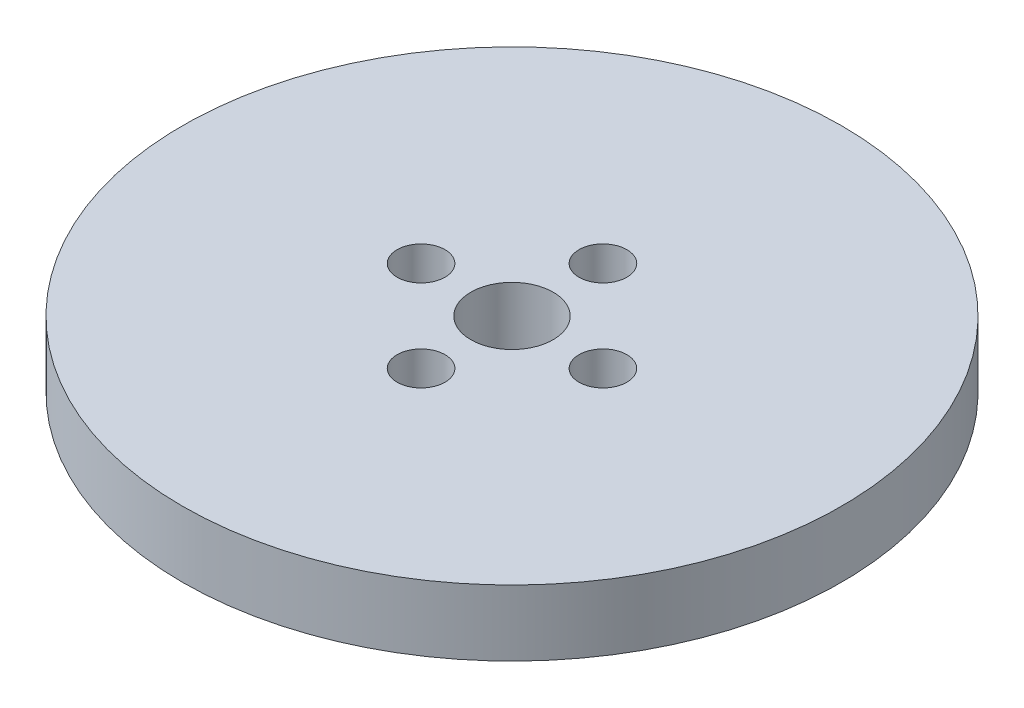
ISO-10303-21;
HEADER;
FILE_DESCRIPTION(('STEP AP214'),'2;1');
FILE_NAME('part.step','',(''),(''),'','','');
FILE_SCHEMA(('AUTOMOTIVE_DESIGN { 1 0 10303 214 1 1 1 1 }'));
ENDSEC;
DATA;
#1=APPLICATION_CONTEXT('core data for automotive mechanical design processes');
#2=APPLICATION_PROTOCOL_DEFINITION('international standard','automotive_design',2000,#1);
#3=PRODUCT_CONTEXT('',#1,'mechanical');
#4=PRODUCT('Part','Part','',(#3));
#5=PRODUCT_RELATED_PRODUCT_CATEGORY('part','',(#4));
#6=PRODUCT_DEFINITION_FORMATION('','',#4);
#7=PRODUCT_DEFINITION_CONTEXT('part definition',#1,'design');
#8=PRODUCT_DEFINITION('design','',#6,#7);
#9=PRODUCT_DEFINITION_SHAPE('','',#8);
#10=(LENGTH_UNIT() NAMED_UNIT(*) SI_UNIT(.MILLI.,.METRE.));
#11=(NAMED_UNIT(*) PLANE_ANGLE_UNIT() SI_UNIT($,.RADIAN.));
#12=(NAMED_UNIT(*) SI_UNIT($,.STERADIAN.) SOLID_ANGLE_UNIT());
#13=UNCERTAINTY_MEASURE_WITH_UNIT(LENGTH_MEASURE(1.E-05),#10,'distance_accuracy_value','');
#14=(GEOMETRIC_REPRESENTATION_CONTEXT(3) GLOBAL_UNCERTAINTY_ASSIGNED_CONTEXT((#13)) GLOBAL_UNIT_ASSIGNED_CONTEXT((#10,
#11,#12)) REPRESENTATION_CONTEXT('',''));
#15=CARTESIAN_POINT('',(0.,0.,0.));
#16=DIRECTION('',(0.,0.,1.));
#17=DIRECTION('',(1.,0.,0.));
#18=AXIS2_PLACEMENT_3D('',#15,#16,#17);
#19=CARTESIAN_POINT('',(0.,8.,0.));
#20=DIRECTION('',(0.,-1.,0.));
#21=DIRECTION('',(0.,0.,-1.));
#22=AXIS2_PLACEMENT_3D('',#19,#20,#21);
#23=CYLINDRICAL_SURFACE('',#22,40.);
#24=CARTESIAN_POINT('',(0.,8.,0.));
#25=DIRECTION('',(0.,1.,0.));
#26=DIRECTION('',(0.,0.,1.));
#27=AXIS2_PLACEMENT_3D('',#24,#25,#26);
#28=CIRCLE('',#27,40.);
#29=CARTESIAN_POINT('',(0.,8.,40.));
#30=VERTEX_POINT('',#29);
#31=EDGE_CURVE('E10',#30,#30,#28,.T.);
#32=ORIENTED_EDGE('',*,*,#31,.F.);
#33=EDGE_LOOP('',(#32));
#34=FACE_BOUND('',#33,.T.);
#35=CARTESIAN_POINT('',(0.,0.,0.));
#36=DIRECTION('',(0.,1.,0.));
#37=DIRECTION('',(0.,0.,1.));
#38=AXIS2_PLACEMENT_3D('',#35,#36,#37);
#39=CIRCLE('',#38,40.);
#40=CARTESIAN_POINT('',(0.,0.,40.));
#41=VERTEX_POINT('',#40);
#42=EDGE_CURVE('E37',#41,#41,#39,.T.);
#43=ORIENTED_EDGE('',*,*,#42,.T.);
#44=EDGE_LOOP('',(#43));
#45=FACE_BOUND('',#44,.T.);
#46=ADVANCED_FACE('F40',(#34,#45),#23,.T.);
#47=CARTESIAN_POINT('',(0.,8.,0.));
#48=DIRECTION('',(0.,1.,0.));
#49=DIRECTION('',(0.,0.,1.));
#50=AXIS2_PLACEMENT_3D('',#47,#48,#49);
#51=PLANE('',#50);
#52=CARTESIAN_POINT('',(0.,8.,11.0372925911838));
#53=DIRECTION('',(0.,1.,0.));
#54=DIRECTION('',(1.,0.,0.));
#55=AXIS2_PLACEMENT_3D('',#52,#53,#54);
#56=CIRCLE('',#55,2.90499558066057);
#57=CARTESIAN_POINT('',(2.90499558066061,8.,11.0372925911838));
#58=VERTEX_POINT('',#57);
#59=EDGE_CURVE('E71',#58,#58,#56,.T.);
#60=ORIENTED_EDGE('',*,*,#59,.F.);
#61=EDGE_LOOP('',(#60));
#62=FACE_BOUND('',#61,.T.);
#63=CARTESIAN_POINT('',(11.0372925911838,8.,0.));
#64=DIRECTION('',(0.,1.,0.));
#65=DIRECTION('',(0.,0.,-1.));
#66=AXIS2_PLACEMENT_3D('',#63,#64,#65);
#67=CIRCLE('',#66,2.90499558066057);
#68=CARTESIAN_POINT('',(11.0372925911838,8.,-2.90499558066057));
#69=VERTEX_POINT('',#68);
#70=EDGE_CURVE('E70',#69,#69,#67,.T.);
#71=ORIENTED_EDGE('',*,*,#70,.F.);
#72=EDGE_LOOP('',(#71));
#73=FACE_BOUND('',#72,.T.);
#74=CARTESIAN_POINT('',(-1.15609503340409E-13,8.,-11.0372925911838));
#75=DIRECTION('',(0.,1.,0.));
#76=DIRECTION('',(-1.,0.,0.));
#77=AXIS2_PLACEMENT_3D('',#74,#75,#76);
#78=CIRCLE('',#77,2.90499558066057);
#79=CARTESIAN_POINT('',(-2.90499558066068,8.,-11.0372925911837));
#80=VERTEX_POINT('',#79);
#81=EDGE_CURVE('E61',#80,#80,#78,.T.);
#82=ORIENTED_EDGE('',*,*,#81,.F.);
#83=EDGE_LOOP('',(#82));
#84=FACE_BOUND('',#83,.T.);
#85=CARTESIAN_POINT('',(-11.0372925911838,8.,0.));
#86=DIRECTION('',(0.,1.,0.));
#87=DIRECTION('',(0.,0.,1.));
#88=AXIS2_PLACEMENT_3D('',#85,#86,#87);
#89=CIRCLE('',#88,2.90499558066057);
#90=CARTESIAN_POINT('',(-11.0372925911838,8.,2.90499558066057));
#91=VERTEX_POINT('',#90);
#92=EDGE_CURVE('E54',#91,#91,#89,.T.);
#93=ORIENTED_EDGE('',*,*,#92,.F.);
#94=EDGE_LOOP('',(#93));
#95=FACE_BOUND('',#94,.T.);
#96=CARTESIAN_POINT('',(0.,8.,0.));
#97=DIRECTION('',(0.,1.,0.));
#98=DIRECTION('',(0.,0.,1.));
#99=AXIS2_PLACEMENT_3D('',#96,#97,#98);
#100=CIRCLE('',#99,5.);
#101=CARTESIAN_POINT('',(0.,8.,5.));
#102=VERTEX_POINT('',#101);
#103=EDGE_CURVE('E50',#102,#102,#100,.T.);
#104=ORIENTED_EDGE('',*,*,#103,.F.);
#105=EDGE_LOOP('',(#104));
#106=FACE_BOUND('',#105,.T.);
#107=ORIENTED_EDGE('',*,*,#31,.T.);
#108=EDGE_LOOP('',(#107));
#109=FACE_BOUND('',#108,.T.);
#110=ADVANCED_FACE('F86',(#62,#73,#84,#95,#106,#109),#51,.T.);
#111=CARTESIAN_POINT('',(0.,0.,0.));
#112=DIRECTION('',(0.,1.,0.));
#113=DIRECTION('',(0.,0.,1.));
#114=AXIS2_PLACEMENT_3D('',#111,#112,#113);
#115=PLANE('',#114);
#116=CARTESIAN_POINT('',(0.,0.,0.));
#117=DIRECTION('',(0.,1.,0.));
#118=DIRECTION('',(0.,0.,1.));
#119=AXIS2_PLACEMENT_3D('',#116,#117,#118);
#120=CIRCLE('',#119,5.);
#121=CARTESIAN_POINT('',(0.,0.,5.));
#122=VERTEX_POINT('',#121);
#123=EDGE_CURVE('E47',#122,#122,#120,.T.);
#124=ORIENTED_EDGE('',*,*,#123,.T.);
#125=EDGE_LOOP('',(#124));
#126=FACE_BOUND('',#125,.T.);
#127=ORIENTED_EDGE('',*,*,#42,.F.);
#128=EDGE_LOOP('',(#127));
#129=FACE_BOUND('',#128,.T.);
#130=ADVANCED_FACE('F93',(#126,#129),#115,.F.);
#131=CARTESIAN_POINT('',(0.,8.,0.));
#132=DIRECTION('',(0.,-1.,0.));
#133=DIRECTION('',(0.,0.,-1.));
#134=AXIS2_PLACEMENT_3D('',#131,#132,#133);
#135=CYLINDRICAL_SURFACE('',#134,5.);
#136=ORIENTED_EDGE('',*,*,#103,.T.);
#137=EDGE_LOOP('',(#136));
#138=FACE_BOUND('',#137,.T.);
#139=ORIENTED_EDGE('',*,*,#123,.F.);
#140=EDGE_LOOP('',(#139));
#141=FACE_BOUND('',#140,.T.);
#142=ADVANCED_FACE('F101',(#138,#141),#135,.F.);
#143=CARTESIAN_POINT('',(-11.0372925911838,1.4396676305779,0.));
#144=DIRECTION('',(0.,1.,0.));
#145=DIRECTION('',(0.,0.,1.));
#146=AXIS2_PLACEMENT_3D('',#143,#144,#145);
#147=CYLINDRICAL_SURFACE('',#146,2.90499558066057);
#148=CARTESIAN_POINT('',(-11.0372925911838,1.4396676305779,0.));
#149=DIRECTION('',(0.,1.,0.));
#150=DIRECTION('',(0.,0.,1.));
#151=AXIS2_PLACEMENT_3D('',#148,#149,#150);
#152=CIRCLE('',#151,2.90499558066057);
#153=CARTESIAN_POINT('',(-11.0372925911838,1.4396676305779,2.90499558066057));
#154=VERTEX_POINT('',#153);
#155=EDGE_CURVE('E55',#154,#154,#152,.T.);
#156=ORIENTED_EDGE('',*,*,#155,.F.);
#157=EDGE_LOOP('',(#156));
#158=FACE_BOUND('',#157,.T.);
#159=ORIENTED_EDGE('',*,*,#92,.T.);
#160=EDGE_LOOP('',(#159));
#161=FACE_BOUND('',#160,.T.);
#162=ADVANCED_FACE('F102',(#158,#161),#147,.F.);
#163=CARTESIAN_POINT('',(-11.0372925911838,1.4396676305779,0.));
#164=DIRECTION('',(0.,1.,0.));
#165=DIRECTION('',(0.,0.,1.));
#166=AXIS2_PLACEMENT_3D('',#163,#164,#165);
#167=PLANE('',#166);
#168=ORIENTED_EDGE('',*,*,#155,.T.);
#169=EDGE_LOOP('',(#168));
#170=FACE_BOUND('',#169,.T.);
#171=ADVANCED_FACE('F133',(#170),#167,.T.);
#172=CARTESIAN_POINT('',(-1.15609503340409E-13,1.4396676305779,-11.0372925911838));
#173=DIRECTION('',(0.,1.,0.));
#174=DIRECTION('',(0.,0.,1.));
#175=AXIS2_PLACEMENT_3D('',#172,#173,#174);
#176=CYLINDRICAL_SURFACE('',#175,2.90499558066057);
#177=CARTESIAN_POINT('',(-1.15609503340409E-13,1.4396676305779,-11.0372925911838));
#178=DIRECTION('',(0.,1.,0.));
#179=DIRECTION('',(-1.,0.,0.));
#180=AXIS2_PLACEMENT_3D('',#177,#178,#179);
#181=CIRCLE('',#180,2.90499558066057);
#182=CARTESIAN_POINT('',(-2.90499558066068,1.4396676305779,-11.0372925911837));
#183=VERTEX_POINT('',#182);
#184=EDGE_CURVE('E63',#183,#183,#181,.T.);
#185=ORIENTED_EDGE('',*,*,#184,.F.);
#186=EDGE_LOOP('',(#185));
#187=FACE_BOUND('',#186,.T.);
#188=ORIENTED_EDGE('',*,*,#81,.T.);
#189=EDGE_LOOP('',(#188));
#190=FACE_BOUND('',#189,.T.);
#191=ADVANCED_FACE('F142',(#187,#190),#176,.F.);
#192=CARTESIAN_POINT('',(-1.15609503340409E-13,1.4396676305779,-11.0372925911838));
#193=DIRECTION('',(0.,1.,0.));
#194=DIRECTION('',(-1.,0.,0.));
#195=AXIS2_PLACEMENT_3D('',#192,#193,#194);
#196=PLANE('',#195);
#197=ORIENTED_EDGE('',*,*,#184,.T.);
#198=EDGE_LOOP('',(#197));
#199=FACE_BOUND('',#198,.T.);
#200=ADVANCED_FACE('F156',(#199),#196,.T.);
#201=CARTESIAN_POINT('',(11.0372925911838,1.4396676305779,0.));
#202=DIRECTION('',(0.,1.,0.));
#203=DIRECTION('',(0.,0.,1.));
#204=AXIS2_PLACEMENT_3D('',#201,#202,#203);
#205=CYLINDRICAL_SURFACE('',#204,2.90499558066057);
#206=CARTESIAN_POINT('',(11.0372925911838,1.4396676305779,0.));
#207=DIRECTION('',(0.,1.,0.));
#208=DIRECTION('',(0.,0.,-1.));
#209=AXIS2_PLACEMENT_3D('',#206,#207,#208);
#210=CIRCLE('',#209,2.90499558066057);
#211=CARTESIAN_POINT('',(11.0372925911838,1.4396676305779,-2.90499558066057));
#212=VERTEX_POINT('',#211);
#213=EDGE_CURVE('E69',#212,#212,#210,.T.);
#214=ORIENTED_EDGE('',*,*,#213,.F.);
#215=EDGE_LOOP('',(#214));
#216=FACE_BOUND('',#215,.T.);
#217=ORIENTED_EDGE('',*,*,#70,.T.);
#218=EDGE_LOOP('',(#217));
#219=FACE_BOUND('',#218,.T.);
#220=ADVANCED_FACE('F164',(#216,#219),#205,.F.);
#221=CARTESIAN_POINT('',(11.0372925911838,1.4396676305779,0.));
#222=DIRECTION('',(0.,1.,0.));
#223=DIRECTION('',(0.,0.,-1.));
#224=AXIS2_PLACEMENT_3D('',#221,#222,#223);
#225=PLANE('',#224);
#226=ORIENTED_EDGE('',*,*,#213,.T.);
#227=EDGE_LOOP('',(#226));
#228=FACE_BOUND('',#227,.T.);
#229=ADVANCED_FACE('F83',(#228),#225,.T.);
#230=CARTESIAN_POINT('',(0.,1.4396676305779,11.0372925911838));
#231=DIRECTION('',(0.,1.,0.));
#232=DIRECTION('',(0.,0.,1.));
#233=AXIS2_PLACEMENT_3D('',#230,#231,#232);
#234=CYLINDRICAL_SURFACE('',#233,2.90499558066057);
#235=CARTESIAN_POINT('',(0.,1.4396676305779,11.0372925911838));
#236=DIRECTION('',(0.,1.,0.));
#237=DIRECTION('',(1.,0.,0.));
#238=AXIS2_PLACEMENT_3D('',#235,#236,#237);
#239=CIRCLE('',#238,2.90499558066057);
#240=CARTESIAN_POINT('',(2.90499558066061,1.4396676305779,11.0372925911838));
#241=VERTEX_POINT('',#240);
#242=EDGE_CURVE('E59',#241,#241,#239,.T.);
#243=ORIENTED_EDGE('',*,*,#242,.F.);
#244=EDGE_LOOP('',(#243));
#245=FACE_BOUND('',#244,.T.);
#246=ORIENTED_EDGE('',*,*,#59,.T.);
#247=EDGE_LOOP('',(#246));
#248=FACE_BOUND('',#247,.T.);
#249=ADVANCED_FACE('F81',(#245,#248),#234,.F.);
#250=CARTESIAN_POINT('',(0.,1.4396676305779,11.0372925911838));
#251=DIRECTION('',(0.,1.,0.));
#252=DIRECTION('',(1.,0.,0.));
#253=AXIS2_PLACEMENT_3D('',#250,#251,#252);
#254=PLANE('',#253);
#255=ORIENTED_EDGE('',*,*,#242,.T.);
#256=EDGE_LOOP('',(#255));
#257=FACE_BOUND('',#256,.T.);
#258=ADVANCED_FACE('F78',(#257),#254,.T.);
#259=CLOSED_SHELL('',(#46,#110,#130,#142,#162,#171,#191,#200,#220,#229,#249,#258));
#260=MANIFOLD_SOLID_BREP('B2',#259);
#261=ADVANCED_BREP_SHAPE_REPRESENTATION('',(#18,#260),#14);
#262=SHAPE_DEFINITION_REPRESENTATION(#9,#261);
ENDSEC;
END-ISO-10303-21;
